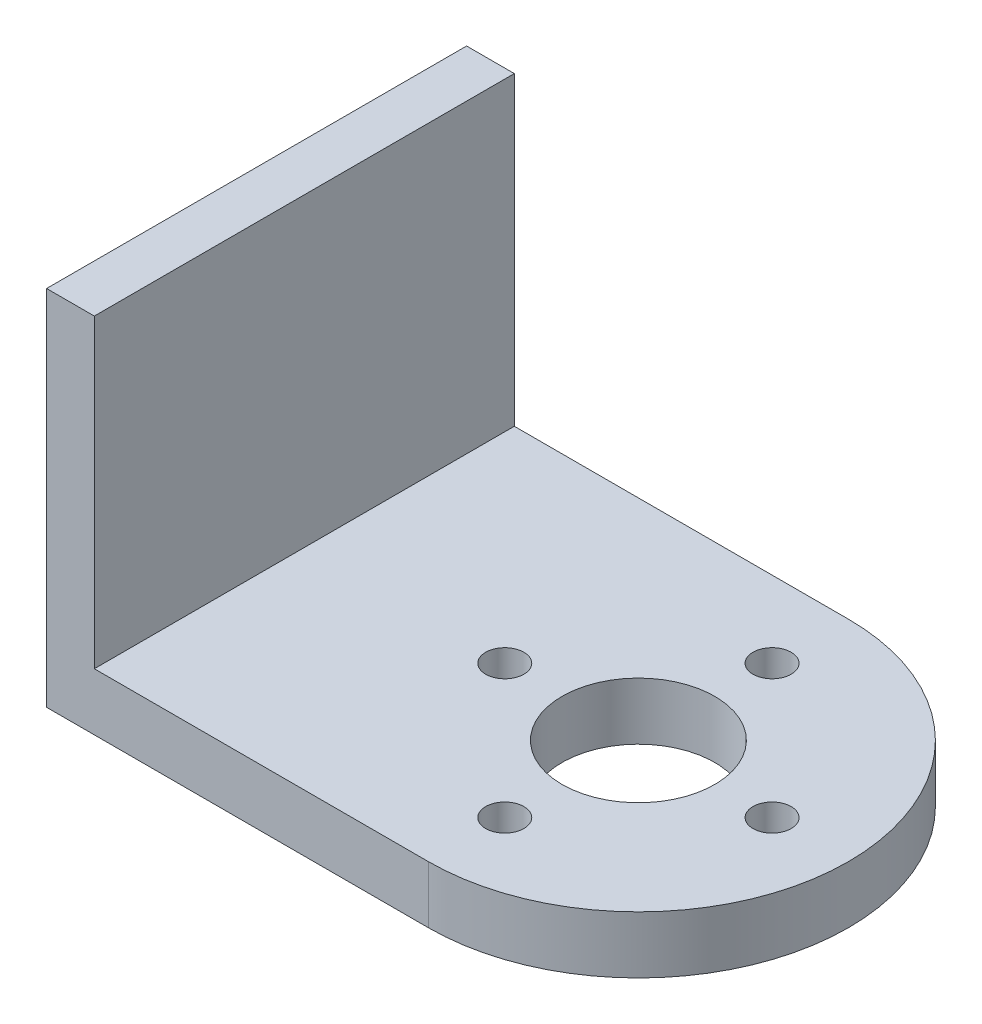
ISO-10303-21;
HEADER;
FILE_DESCRIPTION(('STEP AP214'),'2;1');
FILE_NAME('part.step','',(''),(''),'','','');
FILE_SCHEMA(('AUTOMOTIVE_DESIGN { 1 0 10303 214 1 1 1 1 }'));
ENDSEC;
DATA;
#1=APPLICATION_CONTEXT('core data for automotive mechanical design processes');
#2=APPLICATION_PROTOCOL_DEFINITION('international standard','automotive_design',2000,#1);
#3=PRODUCT_CONTEXT('',#1,'mechanical');
#4=PRODUCT('Part','Part','',(#3));
#5=PRODUCT_RELATED_PRODUCT_CATEGORY('part','',(#4));
#6=PRODUCT_DEFINITION_FORMATION('','',#4);
#7=PRODUCT_DEFINITION_CONTEXT('part definition',#1,'design');
#8=PRODUCT_DEFINITION('design','',#6,#7);
#9=PRODUCT_DEFINITION_SHAPE('','',#8);
#10=(LENGTH_UNIT() NAMED_UNIT(*) SI_UNIT(.MILLI.,.METRE.));
#11=(NAMED_UNIT(*) PLANE_ANGLE_UNIT() SI_UNIT($,.RADIAN.));
#12=(NAMED_UNIT(*) SI_UNIT($,.STERADIAN.) SOLID_ANGLE_UNIT());
#13=UNCERTAINTY_MEASURE_WITH_UNIT(LENGTH_MEASURE(1.E-05),#10,'distance_accuracy_value','');
#14=(GEOMETRIC_REPRESENTATION_CONTEXT(3) GLOBAL_UNCERTAINTY_ASSIGNED_CONTEXT((#13)) GLOBAL_UNIT_ASSIGNED_CONTEXT((#10,
#11,#12)) REPRESENTATION_CONTEXT('',''));
#15=CARTESIAN_POINT('',(0.,0.,0.));
#16=DIRECTION('',(0.,0.,1.));
#17=DIRECTION('',(1.,0.,0.));
#18=AXIS2_PLACEMENT_3D('',#15,#16,#17);
#19=CARTESIAN_POINT('',(6.,3.,0.));
#20=DIRECTION('',(0.,1.,0.));
#21=DIRECTION('',(0.,0.,1.));
#22=AXIS2_PLACEMENT_3D('',#19,#20,#21);
#23=PLANE('',#22);
#24=DIRECTION('',(0.,0.,-1.));
#25=VECTOR('',#24,1.);
#26=CARTESIAN_POINT('',(-11.5,3.,-11.));
#27=LINE('',#26,#25);
#28=CARTESIAN_POINT('',(-11.5,3.,11.));
#29=VERTEX_POINT('',#28);
#30=CARTESIAN_POINT('',(-11.5,3.,-11.));
#31=VERTEX_POINT('',#30);
#32=EDGE_CURVE('E49',#29,#31,#27,.T.);
#33=ORIENTED_EDGE('',*,*,#32,.F.);
#34=DIRECTION('',(1.,0.,0.));
#35=VECTOR('',#34,1.);
#36=CARTESIAN_POINT('',(6.,3.,11.));
#37=LINE('',#36,#35);
#38=CARTESIAN_POINT('',(6.,3.,11.));
#39=VERTEX_POINT('',#38);
#40=EDGE_CURVE('E87',#29,#39,#37,.T.);
#41=ORIENTED_EDGE('',*,*,#40,.T.);
#42=CARTESIAN_POINT('',(6.,3.,0.));
#43=DIRECTION('',(0.,1.,0.));
#44=DIRECTION('',(0.,0.,1.));
#45=AXIS2_PLACEMENT_3D('',#42,#43,#44);
#46=CIRCLE('',#45,11.);
#47=CARTESIAN_POINT('',(6.,3.,-11.));
#48=VERTEX_POINT('',#47);
#49=EDGE_CURVE('E55',#39,#48,#46,.T.);
#50=ORIENTED_EDGE('',*,*,#49,.T.);
#51=DIRECTION('',(-1.,0.,0.));
#52=VECTOR('',#51,1.);
#53=CARTESIAN_POINT('',(-14.,3.,-11.));
#54=LINE('',#53,#52);
#55=EDGE_CURVE('E98',#48,#31,#54,.T.);
#56=ORIENTED_EDGE('',*,*,#55,.T.);
#57=EDGE_LOOP('',(#33,#41,#50,#56));
#58=FACE_BOUND('',#57,.T.);
#59=CARTESIAN_POINT('',(-1.,3.,0.));
#60=DIRECTION('',(0.,1.,0.));
#61=DIRECTION('',(0.,0.,1.));
#62=AXIS2_PLACEMENT_3D('',#59,#60,#61);
#63=CIRCLE('',#62,1.);
#64=CARTESIAN_POINT('',(-1.,3.,0.999999999999951));
#65=VERTEX_POINT('',#64);
#66=EDGE_CURVE('E144',#65,#65,#63,.T.);
#67=ORIENTED_EDGE('',*,*,#66,.F.);
#68=EDGE_LOOP('',(#67));
#69=FACE_BOUND('',#68,.T.);
#70=CARTESIAN_POINT('',(6.,3.,0.));
#71=DIRECTION('',(0.,1.,0.));
#72=DIRECTION('',(0.,0.,1.));
#73=AXIS2_PLACEMENT_3D('',#70,#71,#72);
#74=CIRCLE('',#73,4.);
#75=CARTESIAN_POINT('',(6.,3.,4.));
#76=VERTEX_POINT('',#75);
#77=EDGE_CURVE('E156',#76,#76,#74,.T.);
#78=ORIENTED_EDGE('',*,*,#77,.F.);
#79=EDGE_LOOP('',(#78));
#80=FACE_BOUND('',#79,.T.);
#81=CARTESIAN_POINT('',(13.,3.,0.));
#82=DIRECTION('',(0.,1.,0.));
#83=DIRECTION('',(0.,0.,1.));
#84=AXIS2_PLACEMENT_3D('',#81,#82,#83);
#85=CIRCLE('',#84,1.);
#86=CARTESIAN_POINT('',(13.,3.,1.));
#87=VERTEX_POINT('',#86);
#88=EDGE_CURVE('E103',#87,#87,#85,.T.);
#89=ORIENTED_EDGE('',*,*,#88,.F.);
#90=EDGE_LOOP('',(#89));
#91=FACE_BOUND('',#90,.T.);
#92=CARTESIAN_POINT('',(5.99999999999998,3.,7.));
#93=DIRECTION('',(0.,1.,0.));
#94=DIRECTION('',(0.,0.,1.));
#95=AXIS2_PLACEMENT_3D('',#92,#93,#94);
#96=CIRCLE('',#95,1.);
#97=CARTESIAN_POINT('',(5.99999999999998,3.,8.));
#98=VERTEX_POINT('',#97);
#99=EDGE_CURVE('E150',#98,#98,#96,.T.);
#100=ORIENTED_EDGE('',*,*,#99,.F.);
#101=EDGE_LOOP('',(#100));
#102=FACE_BOUND('',#101,.T.);
#103=CARTESIAN_POINT('',(6.00000000000008,3.,-7.));
#104=DIRECTION('',(0.,1.,0.));
#105=DIRECTION('',(0.,0.,1.));
#106=AXIS2_PLACEMENT_3D('',#103,#104,#105);
#107=CIRCLE('',#106,1.);
#108=CARTESIAN_POINT('',(6.00000000000008,3.,-6.));
#109=VERTEX_POINT('',#108);
#110=EDGE_CURVE('E135',#109,#109,#107,.T.);
#111=ORIENTED_EDGE('',*,*,#110,.F.);
#112=EDGE_LOOP('',(#111));
#113=FACE_BOUND('',#112,.T.);
#114=ADVANCED_FACE('F34',(#58,#69,#80,#91,#102,#113),#23,.T.);
#115=CARTESIAN_POINT('',(6.,0.,0.));
#116=DIRECTION('',(0.,1.,0.));
#117=DIRECTION('',(0.,0.,1.));
#118=AXIS2_PLACEMENT_3D('',#115,#116,#117);
#119=PLANE('',#118);
#120=DIRECTION('',(1.,0.,0.));
#121=VECTOR('',#120,1.);
#122=CARTESIAN_POINT('',(6.,0.,11.));
#123=LINE('',#122,#121);
#124=CARTESIAN_POINT('',(-14.,0.,11.));
#125=VERTEX_POINT('',#124);
#126=CARTESIAN_POINT('',(6.,0.,11.));
#127=VERTEX_POINT('',#126);
#128=EDGE_CURVE('E93',#125,#127,#123,.T.);
#129=ORIENTED_EDGE('',*,*,#128,.F.);
#130=DIRECTION('',(0.,0.,1.));
#131=VECTOR('',#130,1.);
#132=CARTESIAN_POINT('',(-14.,0.,11.));
#133=LINE('',#132,#131);
#134=CARTESIAN_POINT('',(-14.,0.,-11.));
#135=VERTEX_POINT('',#134);
#136=EDGE_CURVE('E75',#135,#125,#133,.T.);
#137=ORIENTED_EDGE('',*,*,#136,.F.);
#138=DIRECTION('',(-1.,0.,0.));
#139=VECTOR('',#138,1.);
#140=CARTESIAN_POINT('',(-14.,0.,-11.));
#141=LINE('',#140,#139);
#142=CARTESIAN_POINT('',(6.,0.,-11.));
#143=VERTEX_POINT('',#142);
#144=EDGE_CURVE('E88',#143,#135,#141,.T.);
#145=ORIENTED_EDGE('',*,*,#144,.F.);
#146=CARTESIAN_POINT('',(6.,0.,0.));
#147=DIRECTION('',(0.,1.,0.));
#148=DIRECTION('',(0.,0.,1.));
#149=AXIS2_PLACEMENT_3D('',#146,#147,#148);
#150=CIRCLE('',#149,11.);
#151=EDGE_CURVE('E102',#127,#143,#150,.T.);
#152=ORIENTED_EDGE('',*,*,#151,.F.);
#153=EDGE_LOOP('',(#129,#137,#145,#152));
#154=FACE_BOUND('',#153,.T.);
#155=CARTESIAN_POINT('',(13.,0.,0.));
#156=DIRECTION('',(0.,1.,0.));
#157=DIRECTION('',(0.,0.,1.));
#158=AXIS2_PLACEMENT_3D('',#155,#156,#157);
#159=CIRCLE('',#158,1.);
#160=CARTESIAN_POINT('',(13.,0.,1.));
#161=VERTEX_POINT('',#160);
#162=EDGE_CURVE('E107',#161,#161,#159,.T.);
#163=ORIENTED_EDGE('',*,*,#162,.T.);
#164=EDGE_LOOP('',(#163));
#165=FACE_BOUND('',#164,.T.);
#166=CARTESIAN_POINT('',(6.,0.,0.));
#167=DIRECTION('',(0.,1.,0.));
#168=DIRECTION('',(0.,0.,1.));
#169=AXIS2_PLACEMENT_3D('',#166,#167,#168);
#170=CIRCLE('',#169,4.);
#171=CARTESIAN_POINT('',(6.,0.,4.));
#172=VERTEX_POINT('',#171);
#173=EDGE_CURVE('E153',#172,#172,#170,.T.);
#174=ORIENTED_EDGE('',*,*,#173,.T.);
#175=EDGE_LOOP('',(#174));
#176=FACE_BOUND('',#175,.T.);
#177=CARTESIAN_POINT('',(5.99999999999998,0.,7.));
#178=DIRECTION('',(0.,1.,0.));
#179=DIRECTION('',(0.,0.,1.));
#180=AXIS2_PLACEMENT_3D('',#177,#178,#179);
#181=CIRCLE('',#180,1.);
#182=CARTESIAN_POINT('',(5.99999999999998,0.,8.));
#183=VERTEX_POINT('',#182);
#184=EDGE_CURVE('E147',#183,#183,#181,.T.);
#185=ORIENTED_EDGE('',*,*,#184,.T.);
#186=EDGE_LOOP('',(#185));
#187=FACE_BOUND('',#186,.T.);
#188=CARTESIAN_POINT('',(-1.,0.,0.));
#189=DIRECTION('',(0.,1.,0.));
#190=DIRECTION('',(0.,0.,1.));
#191=AXIS2_PLACEMENT_3D('',#188,#189,#190);
#192=CIRCLE('',#191,1.);
#193=CARTESIAN_POINT('',(-1.,0.,0.999999999999951));
#194=VERTEX_POINT('',#193);
#195=EDGE_CURVE('E142',#194,#194,#192,.T.);
#196=ORIENTED_EDGE('',*,*,#195,.T.);
#197=EDGE_LOOP('',(#196));
#198=FACE_BOUND('',#197,.T.);
#199=CARTESIAN_POINT('',(6.00000000000008,0.,-7.));
#200=DIRECTION('',(0.,1.,0.));
#201=DIRECTION('',(0.,0.,1.));
#202=AXIS2_PLACEMENT_3D('',#199,#200,#201);
#203=CIRCLE('',#202,1.);
#204=CARTESIAN_POINT('',(6.00000000000008,0.,-6.));
#205=VERTEX_POINT('',#204);
#206=EDGE_CURVE('E131',#205,#205,#203,.T.);
#207=ORIENTED_EDGE('',*,*,#206,.T.);
#208=EDGE_LOOP('',(#207));
#209=FACE_BOUND('',#208,.T.);
#210=ADVANCED_FACE('F100',(#154,#165,#176,#187,#198,#209),#119,.F.);
#211=CARTESIAN_POINT('',(6.,3.,11.));
#212=DIRECTION('',(0.,0.,-1.));
#213=DIRECTION('',(-1.,0.,0.));
#214=AXIS2_PLACEMENT_3D('',#211,#212,#213);
#215=PLANE('',#214);
#216=ORIENTED_EDGE('',*,*,#128,.T.);
#217=DIRECTION('',(0.,-1.,0.));
#218=VECTOR('',#217,1.);
#219=CARTESIAN_POINT('',(6.,3.,11.));
#220=LINE('',#219,#218);
#221=EDGE_CURVE('E11',#39,#127,#220,.T.);
#222=ORIENTED_EDGE('',*,*,#221,.F.);
#223=ORIENTED_EDGE('',*,*,#40,.F.);
#224=DIRECTION('',(0.,-1.,0.));
#225=VECTOR('',#224,1.);
#226=CARTESIAN_POINT('',(-11.5,19.,11.));
#227=LINE('',#226,#225);
#228=CARTESIAN_POINT('',(-11.5,19.,11.));
#229=VERTEX_POINT('',#228);
#230=EDGE_CURVE('E122',#229,#29,#227,.T.);
#231=ORIENTED_EDGE('',*,*,#230,.F.);
#232=DIRECTION('',(1.,0.,0.));
#233=VECTOR('',#232,1.);
#234=CARTESIAN_POINT('',(-11.5,19.,11.));
#235=LINE('',#234,#233);
#236=CARTESIAN_POINT('',(-14.,19.,11.));
#237=VERTEX_POINT('',#236);
#238=EDGE_CURVE('E96',#237,#229,#235,.T.);
#239=ORIENTED_EDGE('',*,*,#238,.F.);
#240=DIRECTION('',(0.,-1.,0.));
#241=VECTOR('',#240,1.);
#242=CARTESIAN_POINT('',(-14.,3.,11.));
#243=LINE('',#242,#241);
#244=EDGE_CURVE('E80',#237,#125,#243,.T.);
#245=ORIENTED_EDGE('',*,*,#244,.T.);
#246=EDGE_LOOP('',(#216,#222,#223,#231,#239,#245));
#247=FACE_BOUND('',#246,.T.);
#248=ADVANCED_FACE('F36',(#247),#215,.F.);
#249=CARTESIAN_POINT('',(6.,3.,0.));
#250=DIRECTION('',(0.,-1.,0.));
#251=DIRECTION('',(0.,0.,-1.));
#252=AXIS2_PLACEMENT_3D('',#249,#250,#251);
#253=CYLINDRICAL_SURFACE('',#252,11.);
#254=ORIENTED_EDGE('',*,*,#151,.T.);
#255=DIRECTION('',(0.,-1.,0.));
#256=VECTOR('',#255,1.);
#257=CARTESIAN_POINT('',(6.,3.,-11.));
#258=LINE('',#257,#256);
#259=EDGE_CURVE('E42',#48,#143,#258,.T.);
#260=ORIENTED_EDGE('',*,*,#259,.F.);
#261=ORIENTED_EDGE('',*,*,#49,.F.);
#262=ORIENTED_EDGE('',*,*,#221,.T.);
#263=EDGE_LOOP('',(#254,#260,#261,#262));
#264=FACE_BOUND('',#263,.T.);
#265=ADVANCED_FACE('F119',(#264),#253,.T.);
#266=CARTESIAN_POINT('',(-14.,3.,-11.));
#267=DIRECTION('',(0.,0.,1.));
#268=DIRECTION('',(1.,0.,0.));
#269=AXIS2_PLACEMENT_3D('',#266,#267,#268);
#270=PLANE('',#269);
#271=ORIENTED_EDGE('',*,*,#144,.T.);
#272=DIRECTION('',(0.,-1.,0.));
#273=VECTOR('',#272,1.);
#274=CARTESIAN_POINT('',(-14.,3.,-11.));
#275=LINE('',#274,#273);
#276=CARTESIAN_POINT('',(-14.,19.,-11.));
#277=VERTEX_POINT('',#276);
#278=EDGE_CURVE('E83',#277,#135,#275,.T.);
#279=ORIENTED_EDGE('',*,*,#278,.F.);
#280=DIRECTION('',(-1.,0.,0.));
#281=VECTOR('',#280,1.);
#282=CARTESIAN_POINT('',(-14.,19.,-11.));
#283=LINE('',#282,#281);
#284=CARTESIAN_POINT('',(-11.5,19.,-11.));
#285=VERTEX_POINT('',#284);
#286=EDGE_CURVE('E137',#285,#277,#283,.T.);
#287=ORIENTED_EDGE('',*,*,#286,.F.);
#288=DIRECTION('',(0.,-1.,0.));
#289=VECTOR('',#288,1.);
#290=CARTESIAN_POINT('',(-11.5,19.,-11.));
#291=LINE('',#290,#289);
#292=EDGE_CURVE('E132',#285,#31,#291,.T.);
#293=ORIENTED_EDGE('',*,*,#292,.T.);
#294=ORIENTED_EDGE('',*,*,#55,.F.);
#295=ORIENTED_EDGE('',*,*,#259,.T.);
#296=EDGE_LOOP('',(#271,#279,#287,#293,#294,#295));
#297=FACE_BOUND('',#296,.T.);
#298=ADVANCED_FACE('F116',(#297),#270,.F.);
#299=CARTESIAN_POINT('',(-14.,3.,11.));
#300=DIRECTION('',(1.,0.,0.));
#301=DIRECTION('',(0.,0.,-1.));
#302=AXIS2_PLACEMENT_3D('',#299,#300,#301);
#303=PLANE('',#302);
#304=ORIENTED_EDGE('',*,*,#136,.T.);
#305=ORIENTED_EDGE('',*,*,#244,.F.);
#306=DIRECTION('',(0.,0.,1.));
#307=VECTOR('',#306,1.);
#308=CARTESIAN_POINT('',(-14.,19.,-11.));
#309=LINE('',#308,#307);
#310=EDGE_CURVE('E171',#277,#237,#309,.T.);
#311=ORIENTED_EDGE('',*,*,#310,.F.);
#312=ORIENTED_EDGE('',*,*,#278,.T.);
#313=EDGE_LOOP('',(#304,#305,#311,#312));
#314=FACE_BOUND('',#313,.T.);
#315=ADVANCED_FACE('F77',(#314),#303,.F.);
#316=CARTESIAN_POINT('',(13.,3.,0.));
#317=DIRECTION('',(0.,-1.,0.));
#318=DIRECTION('',(0.,0.,-1.));
#319=AXIS2_PLACEMENT_3D('',#316,#317,#318);
#320=CYLINDRICAL_SURFACE('',#319,1.);
#321=ORIENTED_EDGE('',*,*,#88,.T.);
#322=EDGE_LOOP('',(#321));
#323=FACE_BOUND('',#322,.T.);
#324=ORIENTED_EDGE('',*,*,#162,.F.);
#325=EDGE_LOOP('',(#324));
#326=FACE_BOUND('',#325,.T.);
#327=ADVANCED_FACE('F191',(#323,#326),#320,.F.);
#328=CARTESIAN_POINT('',(6.,3.,0.));
#329=DIRECTION('',(0.,-1.,0.));
#330=DIRECTION('',(0.,0.,-1.));
#331=AXIS2_PLACEMENT_3D('',#328,#329,#330);
#332=CYLINDRICAL_SURFACE('',#331,4.);
#333=ORIENTED_EDGE('',*,*,#77,.T.);
#334=EDGE_LOOP('',(#333));
#335=FACE_BOUND('',#334,.T.);
#336=ORIENTED_EDGE('',*,*,#173,.F.);
#337=EDGE_LOOP('',(#336));
#338=FACE_BOUND('',#337,.T.);
#339=ADVANCED_FACE('F224',(#335,#338),#332,.F.);
#340=CARTESIAN_POINT('',(5.99999999999998,3.,7.));
#341=DIRECTION('',(0.,-1.,0.));
#342=DIRECTION('',(0.,0.,-1.));
#343=AXIS2_PLACEMENT_3D('',#340,#341,#342);
#344=CYLINDRICAL_SURFACE('',#343,1.);
#345=ORIENTED_EDGE('',*,*,#99,.T.);
#346=EDGE_LOOP('',(#345));
#347=FACE_BOUND('',#346,.T.);
#348=ORIENTED_EDGE('',*,*,#184,.F.);
#349=EDGE_LOOP('',(#348));
#350=FACE_BOUND('',#349,.T.);
#351=ADVANCED_FACE('F234',(#347,#350),#344,.F.);
#352=CARTESIAN_POINT('',(-1.,3.,0.));
#353=DIRECTION('',(0.,-1.,0.));
#354=DIRECTION('',(0.,0.,-1.));
#355=AXIS2_PLACEMENT_3D('',#352,#353,#354);
#356=CYLINDRICAL_SURFACE('',#355,1.);
#357=ORIENTED_EDGE('',*,*,#66,.T.);
#358=EDGE_LOOP('',(#357));
#359=FACE_BOUND('',#358,.T.);
#360=ORIENTED_EDGE('',*,*,#195,.F.);
#361=EDGE_LOOP('',(#360));
#362=FACE_BOUND('',#361,.T.);
#363=ADVANCED_FACE('F243',(#359,#362),#356,.F.);
#364=CARTESIAN_POINT('',(6.00000000000008,3.,-7.));
#365=DIRECTION('',(0.,-1.,0.));
#366=DIRECTION('',(0.,0.,-1.));
#367=AXIS2_PLACEMENT_3D('',#364,#365,#366);
#368=CYLINDRICAL_SURFACE('',#367,1.);
#369=ORIENTED_EDGE('',*,*,#110,.T.);
#370=EDGE_LOOP('',(#369));
#371=FACE_BOUND('',#370,.T.);
#372=ORIENTED_EDGE('',*,*,#206,.F.);
#373=EDGE_LOOP('',(#372));
#374=FACE_BOUND('',#373,.T.);
#375=ADVANCED_FACE('F182',(#371,#374),#368,.F.);
#376=CARTESIAN_POINT('',(-11.5,19.,-11.));
#377=DIRECTION('',(-1.,0.,0.));
#378=DIRECTION('',(0.,0.,1.));
#379=AXIS2_PLACEMENT_3D('',#376,#377,#378);
#380=PLANE('',#379);
#381=ORIENTED_EDGE('',*,*,#32,.T.);
#382=ORIENTED_EDGE('',*,*,#292,.F.);
#383=DIRECTION('',(0.,0.,-1.));
#384=VECTOR('',#383,1.);
#385=CARTESIAN_POINT('',(-11.5,19.,-11.));
#386=LINE('',#385,#384);
#387=EDGE_CURVE('E130',#229,#285,#386,.T.);
#388=ORIENTED_EDGE('',*,*,#387,.F.);
#389=ORIENTED_EDGE('',*,*,#230,.T.);
#390=EDGE_LOOP('',(#381,#382,#388,#389));
#391=FACE_BOUND('',#390,.T.);
#392=ADVANCED_FACE('F126',(#391),#380,.F.);
#393=CARTESIAN_POINT('',(0.,19.,0.));
#394=DIRECTION('',(0.,-1.,0.));
#395=DIRECTION('',(0.,0.,-1.));
#396=AXIS2_PLACEMENT_3D('',#393,#394,#395);
#397=PLANE('',#396);
#398=ORIENTED_EDGE('',*,*,#310,.T.);
#399=ORIENTED_EDGE('',*,*,#238,.T.);
#400=ORIENTED_EDGE('',*,*,#387,.T.);
#401=ORIENTED_EDGE('',*,*,#286,.T.);
#402=EDGE_LOOP('',(#398,#399,#400,#401));
#403=FACE_BOUND('',#402,.T.);
#404=ADVANCED_FACE('F169',(#403),#397,.F.);
#405=CLOSED_SHELL('',(#114,#210,#248,#265,#298,#315,#327,#339,#351,#363,#375,#392,#404));
#406=MANIFOLD_SOLID_BREP('B2',#405);
#407=ADVANCED_BREP_SHAPE_REPRESENTATION('',(#18,#406),#14);
#408=SHAPE_DEFINITION_REPRESENTATION(#9,#407);
ENDSEC;
END-ISO-10303-21;
